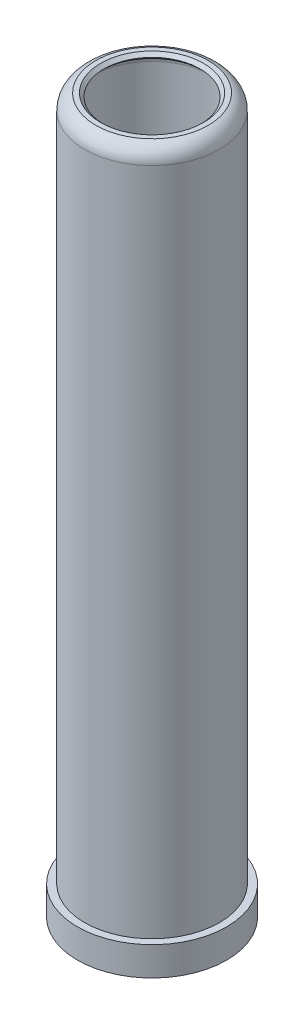
ISO-10303-21;
HEADER;
FILE_DESCRIPTION(('STEP AP214'),'2;1');
FILE_NAME('part.step','',(''),(''),'','','');
FILE_SCHEMA(('AUTOMOTIVE_DESIGN { 1 0 10303 214 1 1 1 1 }'));
ENDSEC;
DATA;
#1=APPLICATION_CONTEXT('core data for automotive mechanical design processes');
#2=APPLICATION_PROTOCOL_DEFINITION('international standard','automotive_design',2000,#1);
#3=PRODUCT_CONTEXT('',#1,'mechanical');
#4=PRODUCT('Part','Part','',(#3));
#5=PRODUCT_RELATED_PRODUCT_CATEGORY('part','',(#4));
#6=PRODUCT_DEFINITION_FORMATION('','',#4);
#7=PRODUCT_DEFINITION_CONTEXT('part definition',#1,'design');
#8=PRODUCT_DEFINITION('design','',#6,#7);
#9=PRODUCT_DEFINITION_SHAPE('','',#8);
#10=(LENGTH_UNIT() NAMED_UNIT(*) SI_UNIT(.MILLI.,.METRE.));
#11=(NAMED_UNIT(*) PLANE_ANGLE_UNIT() SI_UNIT($,.RADIAN.));
#12=(NAMED_UNIT(*) SI_UNIT($,.STERADIAN.) SOLID_ANGLE_UNIT());
#13=UNCERTAINTY_MEASURE_WITH_UNIT(LENGTH_MEASURE(1.E-05),#10,'distance_accuracy_value','');
#14=(GEOMETRIC_REPRESENTATION_CONTEXT(3) GLOBAL_UNCERTAINTY_ASSIGNED_CONTEXT((#13)) GLOBAL_UNIT_ASSIGNED_CONTEXT((#10,
#11,#12)) REPRESENTATION_CONTEXT('',''));
#15=CARTESIAN_POINT('',(0.,0.,0.));
#16=DIRECTION('',(0.,0.,1.));
#17=DIRECTION('',(1.,0.,0.));
#18=AXIS2_PLACEMENT_3D('',#15,#16,#17);
#19=CARTESIAN_POINT('',(-4.77048955893622E-13,139.066923076923,0.));
#20=DIRECTION('',(0.,-1.,0.));
#21=DIRECTION('',(1.,0.,0.));
#22=AXIS2_PLACEMENT_3D('',#19,#20,#21);
#23=TOROIDAL_SURFACE('',#22,10.6730769230776,1.82692307692295);
#24=CARTESIAN_POINT('',(-4.7703417366274E-13,139.066923076923,0.));
#25=DIRECTION('',(0.,-1.,0.));
#26=DIRECTION('',(1.,0.,0.));
#27=AXIS2_PLACEMENT_3D('',#24,#25,#26);
#28=CIRCLE('',#27,12.5000000000005);
#29=CARTESIAN_POINT('',(12.5,139.066923076923,0.));
#30=VERTEX_POINT('',#29);
#31=EDGE_CURVE('E10',#30,#30,#28,.T.);
#32=ORIENTED_EDGE('',*,*,#31,.T.);
#33=EDGE_LOOP('',(#32));
#34=FACE_BOUND('',#33,.T.);
#35=CARTESIAN_POINT('',(-4.83300974718398E-13,140.893846153846,0.));
#36=DIRECTION('',(0.,-1.,0.));
#37=DIRECTION('',(1.,0.,0.));
#38=AXIS2_PLACEMENT_3D('',#35,#36,#37);
#39=CIRCLE('',#38,10.6730769230776);
#40=CARTESIAN_POINT('',(10.6730769230772,140.893846153846,0.));
#41=VERTEX_POINT('',#40);
#42=EDGE_CURVE('E106',#41,#41,#39,.T.);
#43=ORIENTED_EDGE('',*,*,#42,.F.);
#44=EDGE_LOOP('',(#43));
#45=FACE_BOUND('',#44,.T.);
#46=ADVANCED_FACE('F43',(#34,#45),#23,.F.);
#47=CARTESIAN_POINT('',(3.72252080250057E-12,-1085.20425301771,0.));
#48=DIRECTION('',(0.,-1.,0.));
#49=DIRECTION('',(1.,0.,0.));
#50=AXIS2_PLACEMENT_3D('',#47,#48,#49);
#51=CYLINDRICAL_SURFACE('',#50,12.5000000000003);
#52=CARTESIAN_POINT('',(0.,6.9999999999999,0.));
#53=DIRECTION('',(0.,-1.,0.));
#54=DIRECTION('',(1.,0.,0.));
#55=AXIS2_PLACEMENT_3D('',#52,#53,#54);
#56=CIRCLE('',#55,12.5);
#57=CARTESIAN_POINT('',(12.5,6.99999999999994,0.));
#58=VERTEX_POINT('',#57);
#59=EDGE_CURVE('E50',#58,#58,#56,.T.);
#60=ORIENTED_EDGE('',*,*,#59,.T.);
#61=EDGE_LOOP('',(#60));
#62=FACE_BOUND('',#61,.T.);
#63=ORIENTED_EDGE('',*,*,#31,.F.);
#64=EDGE_LOOP('',(#63));
#65=FACE_BOUND('',#64,.T.);
#66=ADVANCED_FACE('F115',(#62,#65),#51,.F.);
#67=CARTESIAN_POINT('',(10.,6.99999999999999,0.));
#68=DIRECTION('',(0.,1.,0.));
#69=DIRECTION('',(-1.,0.,0.));
#70=AXIS2_PLACEMENT_3D('',#67,#68,#69);
#71=PLANE('',#70);
#72=CARTESIAN_POINT('',(0.,6.9999999999999,0.));
#73=DIRECTION('',(0.,-1.,0.));
#74=DIRECTION('',(1.,0.,0.));
#75=AXIS2_PLACEMENT_3D('',#72,#73,#74);
#76=CIRCLE('',#75,10.);
#77=CARTESIAN_POINT('',(10.,6.99999999999993,0.));
#78=VERTEX_POINT('',#77);
#79=EDGE_CURVE('E55',#78,#78,#76,.T.);
#80=ORIENTED_EDGE('',*,*,#79,.T.);
#81=EDGE_LOOP('',(#80));
#82=FACE_BOUND('',#81,.T.);
#83=ORIENTED_EDGE('',*,*,#59,.F.);
#84=EDGE_LOOP('',(#83));
#85=FACE_BOUND('',#84,.T.);
#86=ADVANCED_FACE('F119',(#82,#85),#71,.T.);
#87=CARTESIAN_POINT('',(3.72252080250057E-12,-1085.20425301771,0.));
#88=DIRECTION('',(0.,-1.,0.));
#89=DIRECTION('',(1.,0.,0.));
#90=AXIS2_PLACEMENT_3D('',#87,#88,#89);
#91=CYLINDRICAL_SURFACE('',#90,10.);
#92=CARTESIAN_POINT('',(0.,2.,0.));
#93=DIRECTION('',(0.,-1.,0.));
#94=DIRECTION('',(1.,0.,0.));
#95=AXIS2_PLACEMENT_3D('',#92,#93,#94);
#96=CIRCLE('',#95,10.);
#97=CARTESIAN_POINT('',(10.,2.00000000000004,0.));
#98=VERTEX_POINT('',#97);
#99=EDGE_CURVE('E60',#98,#98,#96,.T.);
#100=ORIENTED_EDGE('',*,*,#99,.T.);
#101=EDGE_LOOP('',(#100));
#102=FACE_BOUND('',#101,.T.);
#103=ORIENTED_EDGE('',*,*,#79,.F.);
#104=EDGE_LOOP('',(#103));
#105=FACE_BOUND('',#104,.T.);
#106=ADVANCED_FACE('F123',(#102,#105),#91,.F.);
#107=CARTESIAN_POINT('',(10.,2.,0.));
#108=DIRECTION('',(0.,-1.,0.));
#109=DIRECTION('',(1.,0.,0.));
#110=AXIS2_PLACEMENT_3D('',#107,#108,#109);
#111=PLANE('',#110);
#112=CARTESIAN_POINT('',(0.,2.,0.));
#113=DIRECTION('',(0.,-1.,0.));
#114=DIRECTION('',(1.,0.,0.));
#115=AXIS2_PLACEMENT_3D('',#112,#113,#114);
#116=CIRCLE('',#115,11.);
#117=CARTESIAN_POINT('',(11.,2.00000000000004,0.));
#118=VERTEX_POINT('',#117);
#119=EDGE_CURVE('E66',#118,#118,#116,.T.);
#120=ORIENTED_EDGE('',*,*,#119,.T.);
#121=EDGE_LOOP('',(#120));
#122=FACE_BOUND('',#121,.T.);
#123=ORIENTED_EDGE('',*,*,#99,.F.);
#124=EDGE_LOOP('',(#123));
#125=FACE_BOUND('',#124,.T.);
#126=ADVANCED_FACE('F130',(#122,#125),#111,.T.);
#127=CARTESIAN_POINT('',(3.72252080250057E-12,-1085.20425301771,0.));
#128=DIRECTION('',(0.,-1.,0.));
#129=DIRECTION('',(1.,0.,0.));
#130=AXIS2_PLACEMENT_3D('',#127,#128,#129);
#131=CYLINDRICAL_SURFACE('',#130,11.);
#132=CARTESIAN_POINT('',(0.,-0.99999999999989,0.));
#133=DIRECTION('',(0.,-1.,0.));
#134=DIRECTION('',(1.,0.,0.));
#135=AXIS2_PLACEMENT_3D('',#132,#133,#134);
#136=CIRCLE('',#135,11.);
#137=CARTESIAN_POINT('',(11.,-0.999999999999852,0.));
#138=VERTEX_POINT('',#137);
#139=EDGE_CURVE('E70',#138,#138,#136,.T.);
#140=ORIENTED_EDGE('',*,*,#139,.T.);
#141=EDGE_LOOP('',(#140));
#142=FACE_BOUND('',#141,.T.);
#143=ORIENTED_EDGE('',*,*,#119,.F.);
#144=EDGE_LOOP('',(#143));
#145=FACE_BOUND('',#144,.T.);
#146=ADVANCED_FACE('F134',(#142,#145),#131,.F.);
#147=CARTESIAN_POINT('',(0.,-6.,0.));
#148=DIRECTION('',(0.,-1.,0.));
#149=DIRECTION('',(1.,0.,0.));
#150=AXIS2_PLACEMENT_3D('',#147,#148,#149);
#151=TOROIDAL_SURFACE('',#150,9.17857142857141,5.32142857142857);
#152=CARTESIAN_POINT('',(0.,-6.00000000000001,0.));
#153=DIRECTION('',(0.,-1.,0.));
#154=DIRECTION('',(1.,0.,0.));
#155=AXIS2_PLACEMENT_3D('',#152,#153,#154);
#156=CIRCLE('',#155,14.5);
#157=CARTESIAN_POINT('',(14.5,-5.99999999999996,0.));
#158=VERTEX_POINT('',#157);
#159=EDGE_CURVE('E74',#158,#158,#156,.T.);
#160=ORIENTED_EDGE('',*,*,#159,.T.);
#161=EDGE_LOOP('',(#160));
#162=FACE_BOUND('',#161,.T.);
#163=ORIENTED_EDGE('',*,*,#139,.F.);
#164=EDGE_LOOP('',(#163));
#165=FACE_BOUND('',#164,.T.);
#166=ADVANCED_FACE('F138',(#162,#165),#151,.F.);
#167=CARTESIAN_POINT('',(15.5,-6.,0.));
#168=DIRECTION('',(0.,-1.,0.));
#169=DIRECTION('',(1.,0.,0.));
#170=AXIS2_PLACEMENT_3D('',#167,#168,#169);
#171=PLANE('',#170);
#172=CARTESIAN_POINT('',(0.,-6.00000000000001,0.));
#173=DIRECTION('',(0.,-1.,0.));
#174=DIRECTION('',(1.,0.,0.));
#175=AXIS2_PLACEMENT_3D('',#172,#173,#174);
#176=CIRCLE('',#175,15.5);
#177=CARTESIAN_POINT('',(15.5,-5.99999999999995,0.));
#178=VERTEX_POINT('',#177);
#179=EDGE_CURVE('E78',#178,#178,#176,.T.);
#180=ORIENTED_EDGE('',*,*,#179,.T.);
#181=EDGE_LOOP('',(#180));
#182=FACE_BOUND('',#181,.T.);
#183=ORIENTED_EDGE('',*,*,#159,.F.);
#184=EDGE_LOOP('',(#183));
#185=FACE_BOUND('',#184,.T.);
#186=ADVANCED_FACE('F142',(#182,#185),#171,.T.);
#187=CARTESIAN_POINT('',(3.72252080250057E-12,-1085.20425301771,0.));
#188=DIRECTION('',(0.,-1.,0.));
#189=DIRECTION('',(1.,0.,0.));
#190=AXIS2_PLACEMENT_3D('',#187,#188,#189);
#191=CYLINDRICAL_SURFACE('',#190,15.5);
#192=CARTESIAN_POINT('',(0.,0.,0.));
#193=DIRECTION('',(0.,-1.,0.));
#194=DIRECTION('',(1.,0.,0.));
#195=AXIS2_PLACEMENT_3D('',#192,#193,#194);
#196=CIRCLE('',#195,15.5);
#197=CARTESIAN_POINT('',(15.5,0.,0.));
#198=VERTEX_POINT('',#197);
#199=EDGE_CURVE('E82',#198,#198,#196,.T.);
#200=ORIENTED_EDGE('',*,*,#199,.T.);
#201=EDGE_LOOP('',(#200));
#202=FACE_BOUND('',#201,.T.);
#203=ORIENTED_EDGE('',*,*,#179,.F.);
#204=EDGE_LOOP('',(#203));
#205=FACE_BOUND('',#204,.T.);
#206=ADVANCED_FACE('F146',(#202,#205),#191,.T.);
#207=CARTESIAN_POINT('',(14.,0.,0.));
#208=DIRECTION('',(0.,1.,0.));
#209=DIRECTION('',(-1.,0.,0.));
#210=AXIS2_PLACEMENT_3D('',#207,#208,#209);
#211=PLANE('',#210);
#212=CARTESIAN_POINT('',(0.,0.,0.));
#213=DIRECTION('',(0.,-1.,0.));
#214=DIRECTION('',(1.,0.,0.));
#215=AXIS2_PLACEMENT_3D('',#212,#213,#214);
#216=CIRCLE('',#215,14.);
#217=CARTESIAN_POINT('',(14.,0.,0.));
#218=VERTEX_POINT('',#217);
#219=EDGE_CURVE('E86',#218,#218,#216,.T.);
#220=ORIENTED_EDGE('',*,*,#219,.T.);
#221=EDGE_LOOP('',(#220));
#222=FACE_BOUND('',#221,.T.);
#223=ORIENTED_EDGE('',*,*,#199,.F.);
#224=EDGE_LOOP('',(#223));
#225=FACE_BOUND('',#224,.T.);
#226=ADVANCED_FACE('F150',(#222,#225),#211,.T.);
#227=CARTESIAN_POINT('',(3.72252080250057E-12,-1085.20425301771,0.));
#228=DIRECTION('',(0.,-1.,0.));
#229=DIRECTION('',(1.,0.,0.));
#230=AXIS2_PLACEMENT_3D('',#227,#228,#229);
#231=CYLINDRICAL_SURFACE('',#230,14.0000000000004);
#232=CARTESIAN_POINT('',(-4.7703417366274E-13,139.066923076923,0.));
#233=DIRECTION('',(0.,-1.,0.));
#234=DIRECTION('',(1.,0.,0.));
#235=AXIS2_PLACEMENT_3D('',#232,#233,#234);
#236=CIRCLE('',#235,14.0000000000007);
#237=CARTESIAN_POINT('',(14.0000000000002,139.066923076923,0.));
#238=VERTEX_POINT('',#237);
#239=EDGE_CURVE('E90',#238,#238,#236,.T.);
#240=ORIENTED_EDGE('',*,*,#239,.T.);
#241=EDGE_LOOP('',(#240));
#242=FACE_BOUND('',#241,.T.);
#243=ORIENTED_EDGE('',*,*,#219,.F.);
#244=EDGE_LOOP('',(#243));
#245=FACE_BOUND('',#244,.T.);
#246=ADVANCED_FACE('F154',(#242,#245),#231,.T.);
#247=CARTESIAN_POINT('',(-4.77048955893622E-13,139.066923076923,0.));
#248=DIRECTION('',(0.,-1.,0.));
#249=DIRECTION('',(1.,0.,0.));
#250=AXIS2_PLACEMENT_3D('',#247,#248,#249);
#251=TOROIDAL_SURFACE('',#250,10.6730769230776,3.32692307692306);
#252=CARTESIAN_POINT('',(-4.87918617601512E-13,142.24,0.));
#253=DIRECTION('',(0.,-1.,0.));
#254=DIRECTION('',(1.,0.,0.));
#255=AXIS2_PLACEMENT_3D('',#252,#253,#254);
#256=CIRCLE('',#255,11.6730769230776);
#257=CARTESIAN_POINT('',(11.6730769230772,142.24,0.));
#258=VERTEX_POINT('',#257);
#259=EDGE_CURVE('E94',#258,#258,#256,.T.);
#260=ORIENTED_EDGE('',*,*,#259,.T.);
#261=EDGE_LOOP('',(#260));
#262=FACE_BOUND('',#261,.T.);
#263=ORIENTED_EDGE('',*,*,#239,.F.);
#264=EDGE_LOOP('',(#263));
#265=FACE_BOUND('',#264,.T.);
#266=ADVANCED_FACE('F158',(#262,#265),#251,.T.);
#267=CARTESIAN_POINT('',(10.6730769230772,142.24,0.));
#268=DIRECTION('',(0.,1.,0.));
#269=DIRECTION('',(-1.,0.,0.));
#270=AXIS2_PLACEMENT_3D('',#267,#268,#269);
#271=PLANE('',#270);
#272=CARTESIAN_POINT('',(-4.87918617601512E-13,142.24,0.));
#273=DIRECTION('',(0.,-1.,0.));
#274=DIRECTION('',(1.,0.,0.));
#275=AXIS2_PLACEMENT_3D('',#272,#273,#274);
#276=CIRCLE('',#275,10.6730769230776);
#277=CARTESIAN_POINT('',(10.6730769230772,142.24,0.));
#278=VERTEX_POINT('',#277);
#279=EDGE_CURVE('E98',#278,#278,#276,.T.);
#280=ORIENTED_EDGE('',*,*,#279,.T.);
#281=EDGE_LOOP('',(#280));
#282=FACE_BOUND('',#281,.T.);
#283=ORIENTED_EDGE('',*,*,#259,.F.);
#284=EDGE_LOOP('',(#283));
#285=FACE_BOUND('',#284,.T.);
#286=ADVANCED_FACE('F162',(#282,#285),#271,.T.);
#287=CARTESIAN_POINT('',(-4.87918617601512E-13,142.24,0.));
#288=DIRECTION('',(0.,1.,0.));
#289=DIRECTION('',(-1.,0.,0.));
#290=AXIS2_PLACEMENT_3D('',#287,#288,#289);
#291=CONICAL_SURFACE('',#290,10.6730769230776,0.785398163397435);
#292=CARTESIAN_POINT('',(-4.85609796159954E-13,141.566923076923,0.));
#293=DIRECTION('',(0.,-1.,0.));
#294=DIRECTION('',(1.,0.,0.));
#295=AXIS2_PLACEMENT_3D('',#292,#293,#294);
#296=CIRCLE('',#295,10.0000000000007);
#297=CARTESIAN_POINT('',(10.0000000000002,141.566923076923,0.));
#298=VERTEX_POINT('',#297);
#299=EDGE_CURVE('E102',#298,#298,#296,.T.);
#300=ORIENTED_EDGE('',*,*,#299,.T.);
#301=EDGE_LOOP('',(#300));
#302=FACE_BOUND('',#301,.T.);
#303=ORIENTED_EDGE('',*,*,#279,.F.);
#304=EDGE_LOOP('',(#303));
#305=FACE_BOUND('',#304,.T.);
#306=ADVANCED_FACE('F166',(#302,#305),#291,.F.);
#307=CARTESIAN_POINT('',(-4.85609796159954E-13,141.566923076923,0.));
#308=DIRECTION('',(0.,-1.,0.));
#309=DIRECTION('',(1.,0.,0.));
#310=AXIS2_PLACEMENT_3D('',#307,#308,#309);
#311=CONICAL_SURFACE('',#310,10.0000000000007,0.785398163397598);
#312=ORIENTED_EDGE('',*,*,#42,.T.);
#313=EDGE_LOOP('',(#312));
#314=FACE_BOUND('',#313,.T.);
#315=ORIENTED_EDGE('',*,*,#299,.F.);
#316=EDGE_LOOP('',(#315));
#317=FACE_BOUND('',#316,.T.);
#318=ADVANCED_FACE('F111',(#314,#317),#311,.F.);
#319=CLOSED_SHELL('',(#46,#66,#86,#106,#126,#146,#166,#186,#206,#226,#246,#266,#286,#306,#318));
#320=MANIFOLD_SOLID_BREP('B2',#319);
#321=ADVANCED_BREP_SHAPE_REPRESENTATION('',(#18,#320),#14);
#322=SHAPE_DEFINITION_REPRESENTATION(#9,#321);
ENDSEC;
END-ISO-10303-21;
